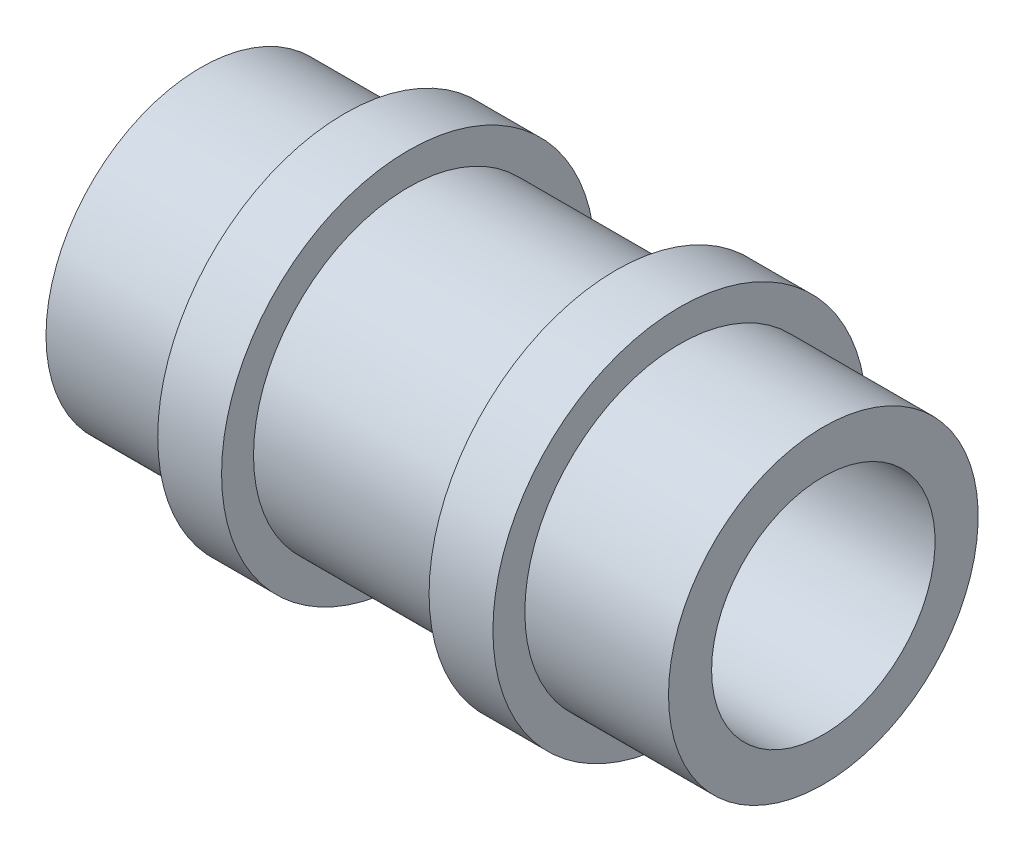
ISO-10303-21;
HEADER;
FILE_DESCRIPTION(('STEP AP214'),'2;1');
FILE_NAME('part.step','',(''),(''),'','','');
FILE_SCHEMA(('AUTOMOTIVE_DESIGN { 1 0 10303 214 1 1 1 1 }'));
ENDSEC;
DATA;
#1=APPLICATION_CONTEXT('core data for automotive mechanical design processes');
#2=APPLICATION_PROTOCOL_DEFINITION('international standard','automotive_design',2000,#1);
#3=PRODUCT_CONTEXT('',#1,'mechanical');
#4=PRODUCT('Part','Part','',(#3));
#5=PRODUCT_RELATED_PRODUCT_CATEGORY('part','',(#4));
#6=PRODUCT_DEFINITION_FORMATION('','',#4);
#7=PRODUCT_DEFINITION_CONTEXT('part definition',#1,'design');
#8=PRODUCT_DEFINITION('design','',#6,#7);
#9=PRODUCT_DEFINITION_SHAPE('','',#8);
#10=(LENGTH_UNIT() NAMED_UNIT(*) SI_UNIT(.MILLI.,.METRE.));
#11=(NAMED_UNIT(*) PLANE_ANGLE_UNIT() SI_UNIT($,.RADIAN.));
#12=(NAMED_UNIT(*) SI_UNIT($,.STERADIAN.) SOLID_ANGLE_UNIT());
#13=UNCERTAINTY_MEASURE_WITH_UNIT(LENGTH_MEASURE(1.E-05),#10,'distance_accuracy_value','');
#14=(GEOMETRIC_REPRESENTATION_CONTEXT(3) GLOBAL_UNCERTAINTY_ASSIGNED_CONTEXT((#13)) GLOBAL_UNIT_ASSIGNED_CONTEXT((#10,
#11,#12)) REPRESENTATION_CONTEXT('',''));
#15=CARTESIAN_POINT('',(0.,0.,0.));
#16=DIRECTION('',(0.,0.,1.));
#17=DIRECTION('',(1.,0.,0.));
#18=AXIS2_PLACEMENT_3D('',#15,#16,#17);
#19=CARTESIAN_POINT('',(0.,0.,0.));
#20=DIRECTION('',(-1.,0.,0.));
#21=DIRECTION('',(0.,0.,1.));
#22=AXIS2_PLACEMENT_3D('',#19,#20,#21);
#23=CYLINDRICAL_SURFACE('',#22,3.5);
#24=CARTESIAN_POINT('',(9.75,0.,0.));
#25=DIRECTION('',(-1.,0.,0.));
#26=DIRECTION('',(0.,0.,1.));
#27=AXIS2_PLACEMENT_3D('',#24,#25,#26);
#28=CIRCLE('',#27,3.5);
#29=CARTESIAN_POINT('',(9.75,0.,3.5));
#30=VERTEX_POINT('',#29);
#31=EDGE_CURVE('E10',#30,#30,#28,.T.);
#32=ORIENTED_EDGE('',*,*,#31,.F.);
#33=EDGE_LOOP('',(#32));
#34=FACE_BOUND('',#33,.T.);
#35=CARTESIAN_POINT('',(-9.75,0.,0.));
#36=DIRECTION('',(-1.,0.,0.));
#37=DIRECTION('',(0.,0.,1.));
#38=AXIS2_PLACEMENT_3D('',#35,#36,#37);
#39=CIRCLE('',#38,3.5);
#40=CARTESIAN_POINT('',(-9.75,0.,3.5));
#41=VERTEX_POINT('',#40);
#42=EDGE_CURVE('E73',#41,#41,#39,.T.);
#43=ORIENTED_EDGE('',*,*,#42,.T.);
#44=EDGE_LOOP('',(#43));
#45=FACE_BOUND('',#44,.T.);
#46=ADVANCED_FACE('F33',(#34,#45),#23,.F.);
#47=CARTESIAN_POINT('',(9.75,3.5,0.));
#48=DIRECTION('',(-1.,0.,0.));
#49=DIRECTION('',(0.,0.,1.));
#50=AXIS2_PLACEMENT_3D('',#47,#48,#49);
#51=PLANE('',#50);
#52=CARTESIAN_POINT('',(9.75,0.,0.));
#53=DIRECTION('',(-1.,0.,0.));
#54=DIRECTION('',(0.,0.,1.));
#55=AXIS2_PLACEMENT_3D('',#52,#53,#54);
#56=CIRCLE('',#55,4.85);
#57=CARTESIAN_POINT('',(9.75,0.,4.85));
#58=VERTEX_POINT('',#57);
#59=EDGE_CURVE('E39',#58,#58,#56,.T.);
#60=ORIENTED_EDGE('',*,*,#59,.F.);
#61=EDGE_LOOP('',(#60));
#62=FACE_BOUND('',#61,.T.);
#63=ORIENTED_EDGE('',*,*,#31,.T.);
#64=EDGE_LOOP('',(#63));
#65=FACE_BOUND('',#64,.T.);
#66=ADVANCED_FACE('F134',(#62,#65),#51,.F.);
#67=CARTESIAN_POINT('',(0.,0.,0.));
#68=DIRECTION('',(-1.,0.,0.));
#69=DIRECTION('',(0.,0.,1.));
#70=AXIS2_PLACEMENT_3D('',#67,#68,#69);
#71=CYLINDRICAL_SURFACE('',#70,4.85);
#72=CARTESIAN_POINT('',(5.25,0.,0.));
#73=DIRECTION('',(-1.,0.,0.));
#74=DIRECTION('',(0.,0.,1.));
#75=AXIS2_PLACEMENT_3D('',#72,#73,#74);
#76=CIRCLE('',#75,4.85);
#77=CARTESIAN_POINT('',(5.25,0.,4.85));
#78=VERTEX_POINT('',#77);
#79=EDGE_CURVE('E43',#78,#78,#76,.T.);
#80=ORIENTED_EDGE('',*,*,#79,.F.);
#81=EDGE_LOOP('',(#80));
#82=FACE_BOUND('',#81,.T.);
#83=ORIENTED_EDGE('',*,*,#59,.T.);
#84=EDGE_LOOP('',(#83));
#85=FACE_BOUND('',#84,.T.);
#86=ADVANCED_FACE('F129',(#82,#85),#71,.T.);
#87=CARTESIAN_POINT('',(5.25,4.85,0.));
#88=DIRECTION('',(-1.,0.,0.));
#89=DIRECTION('',(0.,0.,1.));
#90=AXIS2_PLACEMENT_3D('',#87,#88,#89);
#91=PLANE('',#90);
#92=CARTESIAN_POINT('',(5.25,0.,0.));
#93=DIRECTION('',(-1.,0.,0.));
#94=DIRECTION('',(0.,0.,1.));
#95=AXIS2_PLACEMENT_3D('',#92,#93,#94);
#96=CIRCLE('',#95,5.85);
#97=CARTESIAN_POINT('',(5.25,0.,5.85));
#98=VERTEX_POINT('',#97);
#99=EDGE_CURVE('E47',#98,#98,#96,.T.);
#100=ORIENTED_EDGE('',*,*,#99,.F.);
#101=EDGE_LOOP('',(#100));
#102=FACE_BOUND('',#101,.T.);
#103=ORIENTED_EDGE('',*,*,#79,.T.);
#104=EDGE_LOOP('',(#103));
#105=FACE_BOUND('',#104,.T.);
#106=ADVANCED_FACE('F123',(#102,#105),#91,.F.);
#107=CARTESIAN_POINT('',(0.,0.,0.));
#108=DIRECTION('',(-1.,0.,0.));
#109=DIRECTION('',(0.,0.,1.));
#110=AXIS2_PLACEMENT_3D('',#107,#108,#109);
#111=CYLINDRICAL_SURFACE('',#110,5.85);
#112=CARTESIAN_POINT('',(3.25,0.,0.));
#113=DIRECTION('',(-1.,0.,0.));
#114=DIRECTION('',(0.,0.,1.));
#115=AXIS2_PLACEMENT_3D('',#112,#113,#114);
#116=CIRCLE('',#115,5.85);
#117=CARTESIAN_POINT('',(3.25,0.,5.85));
#118=VERTEX_POINT('',#117);
#119=EDGE_CURVE('E52',#118,#118,#116,.T.);
#120=ORIENTED_EDGE('',*,*,#119,.F.);
#121=EDGE_LOOP('',(#120));
#122=FACE_BOUND('',#121,.T.);
#123=ORIENTED_EDGE('',*,*,#99,.T.);
#124=EDGE_LOOP('',(#123));
#125=FACE_BOUND('',#124,.T.);
#126=ADVANCED_FACE('F117',(#122,#125),#111,.T.);
#127=CARTESIAN_POINT('',(3.25,5.85,0.));
#128=DIRECTION('',(1.,0.,0.));
#129=DIRECTION('',(0.,0.,-1.));
#130=AXIS2_PLACEMENT_3D('',#127,#128,#129);
#131=PLANE('',#130);
#132=CARTESIAN_POINT('',(3.25,0.,0.));
#133=DIRECTION('',(-1.,0.,0.));
#134=DIRECTION('',(0.,0.,1.));
#135=AXIS2_PLACEMENT_3D('',#132,#133,#134);
#136=CIRCLE('',#135,4.85);
#137=CARTESIAN_POINT('',(3.25,0.,4.85));
#138=VERTEX_POINT('',#137);
#139=EDGE_CURVE('E55',#138,#138,#136,.T.);
#140=ORIENTED_EDGE('',*,*,#139,.F.);
#141=EDGE_LOOP('',(#140));
#142=FACE_BOUND('',#141,.T.);
#143=ORIENTED_EDGE('',*,*,#119,.T.);
#144=EDGE_LOOP('',(#143));
#145=FACE_BOUND('',#144,.T.);
#146=ADVANCED_FACE('F111',(#142,#145),#131,.F.);
#147=CARTESIAN_POINT('',(0.,0.,0.));
#148=DIRECTION('',(-1.,0.,0.));
#149=DIRECTION('',(0.,0.,1.));
#150=AXIS2_PLACEMENT_3D('',#147,#148,#149);
#151=CYLINDRICAL_SURFACE('',#150,4.85);
#152=CARTESIAN_POINT('',(-3.25,0.,0.));
#153=DIRECTION('',(-1.,0.,0.));
#154=DIRECTION('',(0.,0.,1.));
#155=AXIS2_PLACEMENT_3D('',#152,#153,#154);
#156=CIRCLE('',#155,4.85);
#157=CARTESIAN_POINT('',(-3.25,0.,4.85));
#158=VERTEX_POINT('',#157);
#159=EDGE_CURVE('E58',#158,#158,#156,.T.);
#160=ORIENTED_EDGE('',*,*,#159,.F.);
#161=EDGE_LOOP('',(#160));
#162=FACE_BOUND('',#161,.T.);
#163=ORIENTED_EDGE('',*,*,#139,.T.);
#164=EDGE_LOOP('',(#163));
#165=FACE_BOUND('',#164,.T.);
#166=ADVANCED_FACE('F105',(#162,#165),#151,.T.);
#167=CARTESIAN_POINT('',(-3.25,4.85,0.));
#168=DIRECTION('',(-1.,0.,0.));
#169=DIRECTION('',(0.,0.,1.));
#170=AXIS2_PLACEMENT_3D('',#167,#168,#169);
#171=PLANE('',#170);
#172=CARTESIAN_POINT('',(-3.25,0.,0.));
#173=DIRECTION('',(-1.,0.,0.));
#174=DIRECTION('',(0.,0.,1.));
#175=AXIS2_PLACEMENT_3D('',#172,#173,#174);
#176=CIRCLE('',#175,5.85);
#177=CARTESIAN_POINT('',(-3.25,0.,5.85));
#178=VERTEX_POINT('',#177);
#179=EDGE_CURVE('E61',#178,#178,#176,.T.);
#180=ORIENTED_EDGE('',*,*,#179,.F.);
#181=EDGE_LOOP('',(#180));
#182=FACE_BOUND('',#181,.T.);
#183=ORIENTED_EDGE('',*,*,#159,.T.);
#184=EDGE_LOOP('',(#183));
#185=FACE_BOUND('',#184,.T.);
#186=ADVANCED_FACE('F99',(#182,#185),#171,.F.);
#187=CARTESIAN_POINT('',(0.,0.,0.));
#188=DIRECTION('',(-1.,0.,0.));
#189=DIRECTION('',(0.,0.,1.));
#190=AXIS2_PLACEMENT_3D('',#187,#188,#189);
#191=CYLINDRICAL_SURFACE('',#190,5.85);
#192=CARTESIAN_POINT('',(-5.25,0.,0.));
#193=DIRECTION('',(-1.,0.,0.));
#194=DIRECTION('',(0.,0.,1.));
#195=AXIS2_PLACEMENT_3D('',#192,#193,#194);
#196=CIRCLE('',#195,5.85);
#197=CARTESIAN_POINT('',(-5.25,0.,5.85));
#198=VERTEX_POINT('',#197);
#199=EDGE_CURVE('E64',#198,#198,#196,.T.);
#200=ORIENTED_EDGE('',*,*,#199,.F.);
#201=EDGE_LOOP('',(#200));
#202=FACE_BOUND('',#201,.T.);
#203=ORIENTED_EDGE('',*,*,#179,.T.);
#204=EDGE_LOOP('',(#203));
#205=FACE_BOUND('',#204,.T.);
#206=ADVANCED_FACE('F93',(#202,#205),#191,.T.);
#207=CARTESIAN_POINT('',(-5.25,5.85,0.));
#208=DIRECTION('',(1.,0.,0.));
#209=DIRECTION('',(0.,0.,-1.));
#210=AXIS2_PLACEMENT_3D('',#207,#208,#209);
#211=PLANE('',#210);
#212=CARTESIAN_POINT('',(-5.25,0.,0.));
#213=DIRECTION('',(-1.,0.,0.));
#214=DIRECTION('',(0.,0.,1.));
#215=AXIS2_PLACEMENT_3D('',#212,#213,#214);
#216=CIRCLE('',#215,4.85);
#217=CARTESIAN_POINT('',(-5.25,0.,4.85));
#218=VERTEX_POINT('',#217);
#219=EDGE_CURVE('E67',#218,#218,#216,.T.);
#220=ORIENTED_EDGE('',*,*,#219,.F.);
#221=EDGE_LOOP('',(#220));
#222=FACE_BOUND('',#221,.T.);
#223=ORIENTED_EDGE('',*,*,#199,.T.);
#224=EDGE_LOOP('',(#223));
#225=FACE_BOUND('',#224,.T.);
#226=ADVANCED_FACE('F87',(#222,#225),#211,.F.);
#227=CARTESIAN_POINT('',(0.,0.,0.));
#228=DIRECTION('',(-1.,0.,0.));
#229=DIRECTION('',(0.,0.,1.));
#230=AXIS2_PLACEMENT_3D('',#227,#228,#229);
#231=CYLINDRICAL_SURFACE('',#230,4.85);
#232=CARTESIAN_POINT('',(-9.75,0.,0.));
#233=DIRECTION('',(-1.,0.,0.));
#234=DIRECTION('',(0.,0.,1.));
#235=AXIS2_PLACEMENT_3D('',#232,#233,#234);
#236=CIRCLE('',#235,4.85);
#237=CARTESIAN_POINT('',(-9.75,0.,4.85));
#238=VERTEX_POINT('',#237);
#239=EDGE_CURVE('E70',#238,#238,#236,.T.);
#240=ORIENTED_EDGE('',*,*,#239,.F.);
#241=EDGE_LOOP('',(#240));
#242=FACE_BOUND('',#241,.T.);
#243=ORIENTED_EDGE('',*,*,#219,.T.);
#244=EDGE_LOOP('',(#243));
#245=FACE_BOUND('',#244,.T.);
#246=ADVANCED_FACE('F81',(#242,#245),#231,.T.);
#247=CARTESIAN_POINT('',(-9.75,4.85,0.));
#248=DIRECTION('',(1.,0.,0.));
#249=DIRECTION('',(0.,0.,-1.));
#250=AXIS2_PLACEMENT_3D('',#247,#248,#249);
#251=PLANE('',#250);
#252=ORIENTED_EDGE('',*,*,#42,.F.);
#253=EDGE_LOOP('',(#252));
#254=FACE_BOUND('',#253,.T.);
#255=ORIENTED_EDGE('',*,*,#239,.T.);
#256=EDGE_LOOP('',(#255));
#257=FACE_BOUND('',#256,.T.);
#258=ADVANCED_FACE('F78',(#254,#257),#251,.F.);
#259=CLOSED_SHELL('',(#46,#66,#86,#106,#126,#146,#166,#186,#206,#226,#246,#258));
#260=MANIFOLD_SOLID_BREP('B2',#259);
#261=ADVANCED_BREP_SHAPE_REPRESENTATION('',(#18,#260),#14);
#262=SHAPE_DEFINITION_REPRESENTATION(#9,#261);
ENDSEC;
END-ISO-10303-21;
